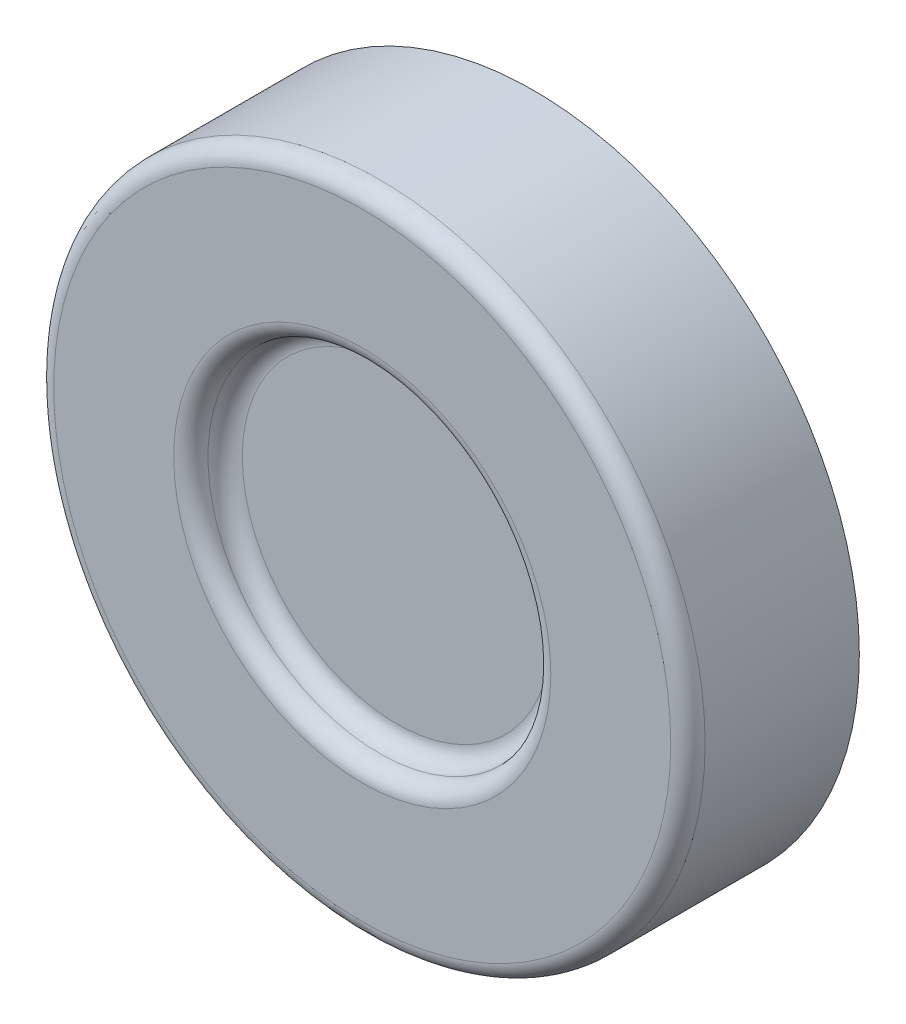
ISO-10303-21;
HEADER;
FILE_DESCRIPTION(('STEP AP214'),'2;1');
FILE_NAME('part.step','',(''),(''),'','','');
FILE_SCHEMA(('AUTOMOTIVE_DESIGN { 1 0 10303 214 1 1 1 1 }'));
ENDSEC;
DATA;
#1=APPLICATION_CONTEXT('core data for automotive mechanical design processes');
#2=APPLICATION_PROTOCOL_DEFINITION('international standard','automotive_design',2000,#1);
#3=PRODUCT_CONTEXT('',#1,'mechanical');
#4=PRODUCT('Part','Part','',(#3));
#5=PRODUCT_RELATED_PRODUCT_CATEGORY('part','',(#4));
#6=PRODUCT_DEFINITION_FORMATION('','',#4);
#7=PRODUCT_DEFINITION_CONTEXT('part definition',#1,'design');
#8=PRODUCT_DEFINITION('design','',#6,#7);
#9=PRODUCT_DEFINITION_SHAPE('','',#8);
#10=(LENGTH_UNIT() NAMED_UNIT(*) SI_UNIT(.MILLI.,.METRE.));
#11=(NAMED_UNIT(*) PLANE_ANGLE_UNIT() SI_UNIT($,.RADIAN.));
#12=(NAMED_UNIT(*) SI_UNIT($,.STERADIAN.) SOLID_ANGLE_UNIT());
#13=UNCERTAINTY_MEASURE_WITH_UNIT(LENGTH_MEASURE(1.E-05),#10,'distance_accuracy_value','');
#14=(GEOMETRIC_REPRESENTATION_CONTEXT(3) GLOBAL_UNCERTAINTY_ASSIGNED_CONTEXT((#13)) GLOBAL_UNIT_ASSIGNED_CONTEXT((#10,
#11,#12)) REPRESENTATION_CONTEXT('',''));
#15=CARTESIAN_POINT('',(0.,0.,0.));
#16=DIRECTION('',(0.,0.,1.));
#17=DIRECTION('',(1.,0.,0.));
#18=AXIS2_PLACEMENT_3D('',#15,#16,#17);
#19=CARTESIAN_POINT('',(0.,0.,10.));
#20=DIRECTION('',(0.,0.,-1.));
#21=DIRECTION('',(-1.,0.,0.));
#22=AXIS2_PLACEMENT_3D('',#19,#20,#21);
#23=CYLINDRICAL_SURFACE('',#22,19.);
#24=CARTESIAN_POINT('',(0.,0.,9.));
#25=DIRECTION('',(0.,0.,1.));
#26=DIRECTION('',(1.,0.,0.));
#27=AXIS2_PLACEMENT_3D('',#24,#25,#26);
#28=CIRCLE('',#27,19.);
#29=CARTESIAN_POINT('',(19.,0.,9.));
#30=VERTEX_POINT('',#29);
#31=EDGE_CURVE('E10',#30,#30,#28,.F.);
#32=ORIENTED_EDGE('',*,*,#31,.T.);
#33=EDGE_LOOP('',(#32));
#34=FACE_BOUND('',#33,.T.);
#35=CARTESIAN_POINT('',(0.,0.,0.));
#36=DIRECTION('',(0.,0.,1.));
#37=DIRECTION('',(1.,0.,0.));
#38=AXIS2_PLACEMENT_3D('',#35,#36,#37);
#39=CIRCLE('',#38,19.);
#40=CARTESIAN_POINT('',(19.,0.,0.));
#41=VERTEX_POINT('',#40);
#42=EDGE_CURVE('E61',#41,#41,#39,.T.);
#43=ORIENTED_EDGE('',*,*,#42,.T.);
#44=EDGE_LOOP('',(#43));
#45=FACE_BOUND('',#44,.T.);
#46=ADVANCED_FACE('F39',(#34,#45),#23,.T.);
#47=CARTESIAN_POINT('',(0.,0.,10.));
#48=DIRECTION('',(0.,0.,1.));
#49=DIRECTION('',(1.,0.,0.));
#50=AXIS2_PLACEMENT_3D('',#47,#48,#49);
#51=PLANE('',#50);
#52=CARTESIAN_POINT('',(0.,0.,10.));
#53=DIRECTION('',(0.,0.,1.));
#54=DIRECTION('',(1.,0.,0.));
#55=AXIS2_PLACEMENT_3D('',#52,#53,#54);
#56=CIRCLE('',#55,11.);
#57=CARTESIAN_POINT('',(11.,0.,10.));
#58=VERTEX_POINT('',#57);
#59=EDGE_CURVE('E48',#58,#58,#56,.F.);
#60=ORIENTED_EDGE('',*,*,#59,.T.);
#61=EDGE_LOOP('',(#60));
#62=FACE_BOUND('',#61,.T.);
#63=CARTESIAN_POINT('',(0.,0.,10.));
#64=DIRECTION('',(0.,0.,1.));
#65=DIRECTION('',(1.,0.,0.));
#66=AXIS2_PLACEMENT_3D('',#63,#64,#65);
#67=CIRCLE('',#66,18.);
#68=CARTESIAN_POINT('',(18.,0.,10.));
#69=VERTEX_POINT('',#68);
#70=EDGE_CURVE('E53',#69,#69,#67,.T.);
#71=ORIENTED_EDGE('',*,*,#70,.T.);
#72=EDGE_LOOP('',(#71));
#73=FACE_BOUND('',#72,.T.);
#74=ADVANCED_FACE('F86',(#62,#73),#51,.T.);
#75=CARTESIAN_POINT('',(0.,0.,0.));
#76=DIRECTION('',(0.,0.,1.));
#77=DIRECTION('',(1.,0.,0.));
#78=AXIS2_PLACEMENT_3D('',#75,#76,#77);
#79=PLANE('',#78);
#80=ORIENTED_EDGE('',*,*,#42,.F.);
#81=EDGE_LOOP('',(#80));
#82=FACE_BOUND('',#81,.T.);
#83=ADVANCED_FACE('F81',(#82),#79,.F.);
#84=CARTESIAN_POINT('',(0.,0.,8.));
#85=DIRECTION('',(0.,0.,1.));
#86=DIRECTION('',(1.,0.,0.));
#87=AXIS2_PLACEMENT_3D('',#84,#85,#86);
#88=PLANE('',#87);
#89=CARTESIAN_POINT('',(0.,0.,8.));
#90=DIRECTION('',(0.,0.,1.));
#91=DIRECTION('',(1.,0.,0.));
#92=AXIS2_PLACEMENT_3D('',#89,#90,#91);
#93=CIRCLE('',#92,9.);
#94=CARTESIAN_POINT('',(9.,0.,8.));
#95=VERTEX_POINT('',#94);
#96=EDGE_CURVE('E58',#95,#95,#93,.T.);
#97=ORIENTED_EDGE('',*,*,#96,.T.);
#98=EDGE_LOOP('',(#97));
#99=FACE_BOUND('',#98,.T.);
#100=ADVANCED_FACE('F74',(#99),#88,.T.);
#101=CARTESIAN_POINT('',(0.,0.,9.));
#102=DIRECTION('',(0.,0.,1.));
#103=DIRECTION('',(1.,0.,0.));
#104=AXIS2_PLACEMENT_3D('',#101,#102,#103);
#105=TOROIDAL_SURFACE('',#104,11.,1.);
#106=ORIENTED_EDGE('',*,*,#59,.F.);
#107=EDGE_LOOP('',(#106));
#108=FACE_BOUND('',#107,.T.);
#109=CARTESIAN_POINT('',(0.,0.,9.));
#110=DIRECTION('',(0.,0.,1.));
#111=DIRECTION('',(1.,0.,0.));
#112=AXIS2_PLACEMENT_3D('',#109,#110,#111);
#113=CIRCLE('',#112,10.);
#114=CARTESIAN_POINT('',(10.,0.,9.));
#115=VERTEX_POINT('',#114);
#116=EDGE_CURVE('E43',#115,#115,#113,.T.);
#117=ORIENTED_EDGE('',*,*,#116,.F.);
#118=EDGE_LOOP('',(#117));
#119=FACE_BOUND('',#118,.T.);
#120=ADVANCED_FACE('F72',(#108,#119),#105,.T.);
#121=CARTESIAN_POINT('',(0.,0.,9.));
#122=DIRECTION('',(0.,0.,1.));
#123=DIRECTION('',(1.,0.,0.));
#124=AXIS2_PLACEMENT_3D('',#121,#122,#123);
#125=TOROIDAL_SURFACE('',#124,9.,1.);
#126=ORIENTED_EDGE('',*,*,#116,.T.);
#127=EDGE_LOOP('',(#126));
#128=FACE_BOUND('',#127,.T.);
#129=ORIENTED_EDGE('',*,*,#96,.F.);
#130=EDGE_LOOP('',(#129));
#131=FACE_BOUND('',#130,.T.);
#132=ADVANCED_FACE('F69',(#128,#131),#125,.F.);
#133=CARTESIAN_POINT('',(0.,0.,9.));
#134=DIRECTION('',(0.,0.,1.));
#135=DIRECTION('',(1.,0.,0.));
#136=AXIS2_PLACEMENT_3D('',#133,#134,#135);
#137=TOROIDAL_SURFACE('',#136,18.,1.);
#138=ORIENTED_EDGE('',*,*,#31,.F.);
#139=EDGE_LOOP('',(#138));
#140=FACE_BOUND('',#139,.T.);
#141=ORIENTED_EDGE('',*,*,#70,.F.);
#142=EDGE_LOOP('',(#141));
#143=FACE_BOUND('',#142,.T.);
#144=ADVANCED_FACE('F41',(#140,#143),#137,.T.);
#145=CLOSED_SHELL('',(#46,#74,#83,#100,#120,#132,#144));
#146=MANIFOLD_SOLID_BREP('B2',#145);
#147=ADVANCED_BREP_SHAPE_REPRESENTATION('',(#18,#146),#14);
#148=SHAPE_DEFINITION_REPRESENTATION(#9,#147);
ENDSEC;
END-ISO-10303-21;
